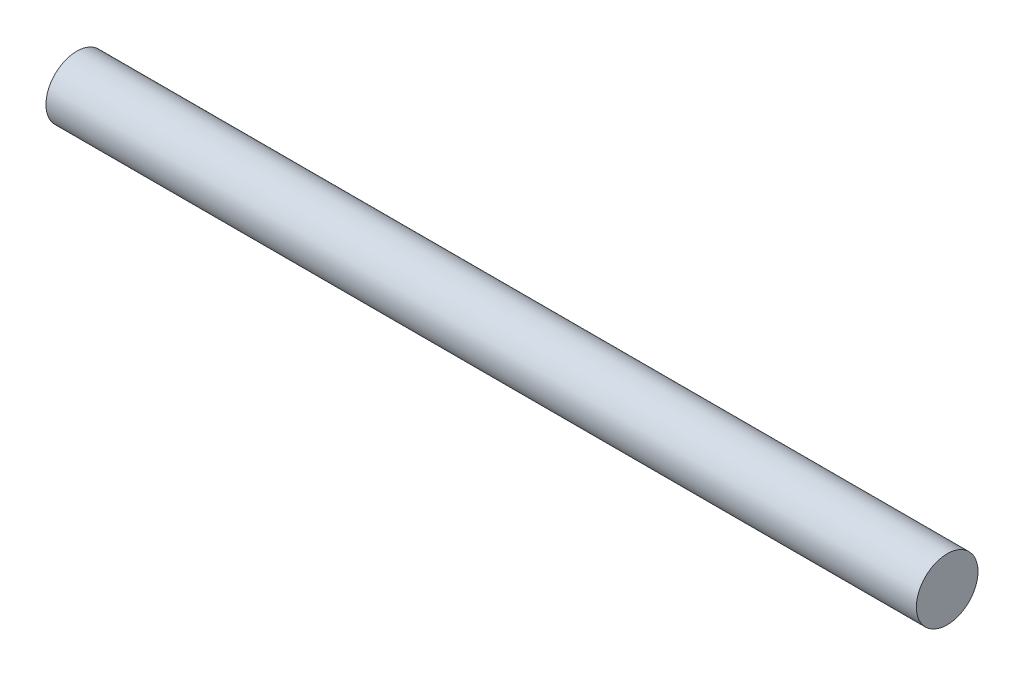
ISO-10303-21;
HEADER;
FILE_DESCRIPTION(('STEP AP214'),'2;1');
FILE_NAME('part.step','',(''),(''),'','','');
FILE_SCHEMA(('AUTOMOTIVE_DESIGN { 1 0 10303 214 1 1 1 1 }'));
ENDSEC;
DATA;
#1=APPLICATION_CONTEXT('core data for automotive mechanical design processes');
#2=APPLICATION_PROTOCOL_DEFINITION('international standard','automotive_design',2000,#1);
#3=PRODUCT_CONTEXT('',#1,'mechanical');
#4=PRODUCT('Part','Part','',(#3));
#5=PRODUCT_RELATED_PRODUCT_CATEGORY('part','',(#4));
#6=PRODUCT_DEFINITION_FORMATION('','',#4);
#7=PRODUCT_DEFINITION_CONTEXT('part definition',#1,'design');
#8=PRODUCT_DEFINITION('design','',#6,#7);
#9=PRODUCT_DEFINITION_SHAPE('','',#8);
#10=(LENGTH_UNIT() NAMED_UNIT(*) SI_UNIT(.MILLI.,.METRE.));
#11=(NAMED_UNIT(*) PLANE_ANGLE_UNIT() SI_UNIT($,.RADIAN.));
#12=(NAMED_UNIT(*) SI_UNIT($,.STERADIAN.) SOLID_ANGLE_UNIT());
#13=UNCERTAINTY_MEASURE_WITH_UNIT(LENGTH_MEASURE(1.E-05),#10,'distance_accuracy_value','');
#14=(GEOMETRIC_REPRESENTATION_CONTEXT(3) GLOBAL_UNCERTAINTY_ASSIGNED_CONTEXT((#13)) GLOBAL_UNIT_ASSIGNED_CONTEXT((#10,
#11,#12)) REPRESENTATION_CONTEXT('',''));
#15=CARTESIAN_POINT('',(0.,0.,0.));
#16=DIRECTION('',(0.,0.,1.));
#17=DIRECTION('',(1.,0.,0.));
#18=AXIS2_PLACEMENT_3D('',#15,#16,#17);
#19=CARTESIAN_POINT('',(716.28,0.,0.));
#20=DIRECTION('',(-1.,0.,0.));
#21=DIRECTION('',(0.,0.,1.));
#22=AXIS2_PLACEMENT_3D('',#19,#20,#21);
#23=CYLINDRICAL_SURFACE('',#22,25.365);
#24=CARTESIAN_POINT('',(716.28,0.,0.));
#25=DIRECTION('',(1.,0.,0.));
#26=DIRECTION('',(0.,0.,-1.));
#27=AXIS2_PLACEMENT_3D('',#24,#25,#26);
#28=CIRCLE('',#27,25.365);
#29=CARTESIAN_POINT('',(716.28,0.,-25.365));
#30=VERTEX_POINT('',#29);
#31=EDGE_CURVE('E10',#30,#30,#28,.T.);
#32=ORIENTED_EDGE('',*,*,#31,.F.);
#33=EDGE_LOOP('',(#32));
#34=FACE_BOUND('',#33,.T.);
#35=CARTESIAN_POINT('',(0.,0.,0.));
#36=DIRECTION('',(1.,0.,0.));
#37=DIRECTION('',(0.,0.,-1.));
#38=AXIS2_PLACEMENT_3D('',#35,#36,#37);
#39=CIRCLE('',#38,25.365);
#40=CARTESIAN_POINT('',(0.,0.,-25.365));
#41=VERTEX_POINT('',#40);
#42=EDGE_CURVE('E34',#41,#41,#39,.T.);
#43=ORIENTED_EDGE('',*,*,#42,.T.);
#44=EDGE_LOOP('',(#43));
#45=FACE_BOUND('',#44,.T.);
#46=ADVANCED_FACE('F31',(#34,#45),#23,.T.);
#47=CARTESIAN_POINT('',(716.28,0.,0.));
#48=DIRECTION('',(1.,0.,0.));
#49=DIRECTION('',(0.,0.,-1.));
#50=AXIS2_PLACEMENT_3D('',#47,#48,#49);
#51=PLANE('',#50);
#52=ORIENTED_EDGE('',*,*,#31,.T.);
#53=EDGE_LOOP('',(#52));
#54=FACE_BOUND('',#53,.T.);
#55=ADVANCED_FACE('F46',(#54),#51,.T.);
#56=CARTESIAN_POINT('',(0.,0.,0.));
#57=DIRECTION('',(1.,0.,0.));
#58=DIRECTION('',(0.,0.,-1.));
#59=AXIS2_PLACEMENT_3D('',#56,#57,#58);
#60=PLANE('',#59);
#61=ORIENTED_EDGE('',*,*,#42,.F.);
#62=EDGE_LOOP('',(#61));
#63=FACE_BOUND('',#62,.T.);
#64=ADVANCED_FACE('F44',(#63),#60,.F.);
#65=CLOSED_SHELL('',(#46,#55,#64));
#66=MANIFOLD_SOLID_BREP('B2',#65);
#67=ADVANCED_BREP_SHAPE_REPRESENTATION('',(#18,#66),#14);
#68=SHAPE_DEFINITION_REPRESENTATION(#9,#67);
ENDSEC;
END-ISO-10303-21;
